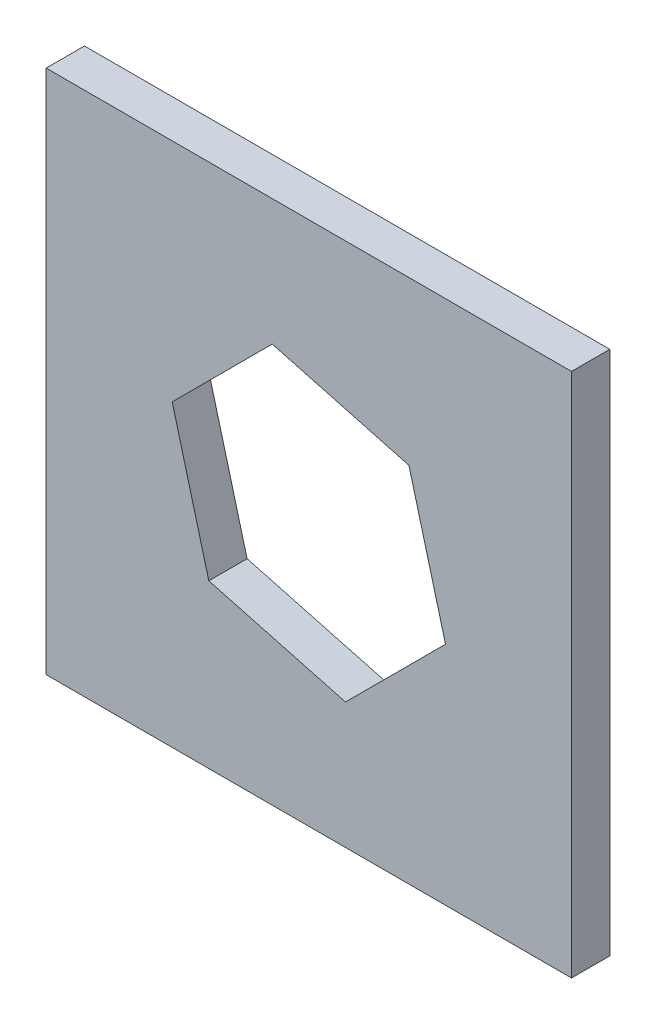
ISO-10303-21;
HEADER;
FILE_DESCRIPTION(('STEP AP214'),'2;1');
FILE_NAME('part.step','',(''),(''),'','','');
FILE_SCHEMA(('AUTOMOTIVE_DESIGN { 1 0 10303 214 1 1 1 1 }'));
ENDSEC;
DATA;
#1=APPLICATION_CONTEXT('core data for automotive mechanical design processes');
#2=APPLICATION_PROTOCOL_DEFINITION('international standard','automotive_design',2000,#1);
#3=PRODUCT_CONTEXT('',#1,'mechanical');
#4=PRODUCT('Part','Part','',(#3));
#5=PRODUCT_RELATED_PRODUCT_CATEGORY('part','',(#4));
#6=PRODUCT_DEFINITION_FORMATION('','',#4);
#7=PRODUCT_DEFINITION_CONTEXT('part definition',#1,'design');
#8=PRODUCT_DEFINITION('design','',#6,#7);
#9=PRODUCT_DEFINITION_SHAPE('','',#8);
#10=(LENGTH_UNIT() NAMED_UNIT(*) SI_UNIT(.MILLI.,.METRE.));
#11=(NAMED_UNIT(*) PLANE_ANGLE_UNIT() SI_UNIT($,.RADIAN.));
#12=(NAMED_UNIT(*) SI_UNIT($,.STERADIAN.) SOLID_ANGLE_UNIT());
#13=UNCERTAINTY_MEASURE_WITH_UNIT(LENGTH_MEASURE(1.E-05),#10,'distance_accuracy_value','');
#14=(GEOMETRIC_REPRESENTATION_CONTEXT(3) GLOBAL_UNCERTAINTY_ASSIGNED_CONTEXT((#13)) GLOBAL_UNIT_ASSIGNED_CONTEXT((#10,
#11,#12)) REPRESENTATION_CONTEXT('',''));
#15=CARTESIAN_POINT('',(0.,0.,0.));
#16=DIRECTION('',(0.,0.,1.));
#17=DIRECTION('',(1.,0.,0.));
#18=AXIS2_PLACEMENT_3D('',#15,#16,#17);
#19=CARTESIAN_POINT('',(0.,0.,2.5));
#20=DIRECTION('',(0.,0.,1.));
#21=DIRECTION('',(1.,0.,0.));
#22=AXIS2_PLACEMENT_3D('',#19,#20,#21);
#23=PLANE('',#22);
#24=DIRECTION('',(0.,-1.,0.));
#25=VECTOR('',#24,1.);
#26=CARTESIAN_POINT('',(-17.15,-17.15,2.5));
#27=LINE('',#26,#25);
#28=CARTESIAN_POINT('',(-17.15,17.15,2.5));
#29=VERTEX_POINT('',#28);
#30=CARTESIAN_POINT('',(-17.15,-17.15,2.5));
#31=VERTEX_POINT('',#30);
#32=EDGE_CURVE('E163',#29,#31,#27,.T.);
#33=ORIENTED_EDGE('',*,*,#32,.T.);
#34=DIRECTION('',(1.,0.,0.));
#35=VECTOR('',#34,1.);
#36=CARTESIAN_POINT('',(17.15,-17.15,2.5));
#37=LINE('',#36,#35);
#38=CARTESIAN_POINT('',(17.15,-17.15,2.5));
#39=VERTEX_POINT('',#38);
#40=EDGE_CURVE('E166',#31,#39,#37,.T.);
#41=ORIENTED_EDGE('',*,*,#40,.T.);
#42=DIRECTION('',(0.,1.,0.));
#43=VECTOR('',#42,1.);
#44=CARTESIAN_POINT('',(17.15,-17.15,2.5));
#45=LINE('',#44,#43);
#46=CARTESIAN_POINT('',(17.15,17.15,2.5));
#47=VERTEX_POINT('',#46);
#48=EDGE_CURVE('E169',#39,#47,#45,.T.);
#49=ORIENTED_EDGE('',*,*,#48,.T.);
#50=DIRECTION('',(-1.,0.,0.));
#51=VECTOR('',#50,1.);
#52=CARTESIAN_POINT('',(17.15,17.15,2.5));
#53=LINE('',#52,#51);
#54=EDGE_CURVE('E171',#47,#29,#53,.T.);
#55=ORIENTED_EDGE('',*,*,#54,.T.);
#56=EDGE_LOOP('',(#33,#41,#49,#55));
#57=FACE_BOUND('',#56,.T.);
#58=DIRECTION('',(-0.965925826289068,0.258819045102521,0.));
#59=VECTOR('',#58,1.);
#60=CARTESIAN_POINT('',(6.53197264742181,6.5319726474218,2.5));
#61=LINE('',#60,#59);
#62=CARTESIAN_POINT('',(6.53197264742181,6.5319726474218,2.5));
#63=VERTEX_POINT('',#62);
#64=CARTESIAN_POINT('',(-2.39086792578148,8.92284057320328,2.5));
#65=VERTEX_POINT('',#64);
#66=EDGE_CURVE('E120',#63,#65,#61,.T.);
#67=ORIENTED_EDGE('',*,*,#66,.F.);
#68=DIRECTION('',(-0.258819045102521,0.965925826289068,0.));
#69=VECTOR('',#68,1.);
#70=CARTESIAN_POINT('',(8.92284057320328,-2.39086792578148,2.5));
#71=LINE('',#70,#69);
#72=CARTESIAN_POINT('',(8.92284057320328,-2.39086792578148,2.5));
#73=VERTEX_POINT('',#72);
#74=EDGE_CURVE('E112',#73,#63,#71,.T.);
#75=ORIENTED_EDGE('',*,*,#74,.F.);
#76=DIRECTION('',(0.707106781186547,0.707106781186548,0.));
#77=VECTOR('',#76,1.);
#78=CARTESIAN_POINT('',(2.39086792578148,-8.92284057320329,2.5));
#79=LINE('',#78,#77);
#80=CARTESIAN_POINT('',(2.39086792578148,-8.92284057320329,2.5));
#81=VERTEX_POINT('',#80);
#82=EDGE_CURVE('E141',#81,#73,#79,.T.);
#83=ORIENTED_EDGE('',*,*,#82,.F.);
#84=DIRECTION('',(0.965925826289068,-0.258819045102521,0.));
#85=VECTOR('',#84,1.);
#86=CARTESIAN_POINT('',(-6.53197264742181,-6.53197264742181,2.5));
#87=LINE('',#86,#85);
#88=CARTESIAN_POINT('',(-6.53197264742181,-6.53197264742181,2.5));
#89=VERTEX_POINT('',#88);
#90=EDGE_CURVE('E139',#89,#81,#87,.T.);
#91=ORIENTED_EDGE('',*,*,#90,.F.);
#92=DIRECTION('',(0.258819045102521,-0.965925826289068,0.));
#93=VECTOR('',#92,1.);
#94=CARTESIAN_POINT('',(-8.92284057320329,2.39086792578147,2.5));
#95=LINE('',#94,#93);
#96=CARTESIAN_POINT('',(-8.92284057320329,2.39086792578147,2.5));
#97=VERTEX_POINT('',#96);
#98=EDGE_CURVE('E135',#97,#89,#95,.T.);
#99=ORIENTED_EDGE('',*,*,#98,.F.);
#100=DIRECTION('',(-0.707106781186547,-0.707106781186547,0.));
#101=VECTOR('',#100,1.);
#102=CARTESIAN_POINT('',(-2.39086792578148,8.92284057320328,2.5));
#103=LINE('',#102,#101);
#104=EDGE_CURVE('E133',#65,#97,#103,.T.);
#105=ORIENTED_EDGE('',*,*,#104,.F.);
#106=EDGE_LOOP('',(#67,#75,#83,#91,#99,#105));
#107=FACE_BOUND('',#106,.T.);
#108=ADVANCED_FACE('F35',(#57,#107),#23,.T.);
#109=CARTESIAN_POINT('',(0.,0.,0.));
#110=DIRECTION('',(0.,0.,1.));
#111=DIRECTION('',(1.,0.,0.));
#112=AXIS2_PLACEMENT_3D('',#109,#110,#111);
#113=PLANE('',#112);
#114=DIRECTION('',(0.,-1.,0.));
#115=VECTOR('',#114,1.);
#116=CARTESIAN_POINT('',(-17.15,-17.15,0.));
#117=LINE('',#116,#115);
#118=CARTESIAN_POINT('',(-17.15,17.15,0.));
#119=VERTEX_POINT('',#118);
#120=CARTESIAN_POINT('',(-17.15,-17.15,0.));
#121=VERTEX_POINT('',#120);
#122=EDGE_CURVE('E128',#119,#121,#117,.T.);
#123=ORIENTED_EDGE('',*,*,#122,.F.);
#124=DIRECTION('',(-1.,0.,0.));
#125=VECTOR('',#124,1.);
#126=CARTESIAN_POINT('',(17.15,17.15,0.));
#127=LINE('',#126,#125);
#128=CARTESIAN_POINT('',(17.15,17.15,0.));
#129=VERTEX_POINT('',#128);
#130=EDGE_CURVE('E167',#129,#119,#127,.T.);
#131=ORIENTED_EDGE('',*,*,#130,.F.);
#132=DIRECTION('',(0.,1.,0.));
#133=VECTOR('',#132,1.);
#134=CARTESIAN_POINT('',(17.15,-17.15,0.));
#135=LINE('',#134,#133);
#136=CARTESIAN_POINT('',(17.15,-17.15,0.));
#137=VERTEX_POINT('',#136);
#138=EDGE_CURVE('E178',#137,#129,#135,.T.);
#139=ORIENTED_EDGE('',*,*,#138,.F.);
#140=DIRECTION('',(1.,0.,0.));
#141=VECTOR('',#140,1.);
#142=CARTESIAN_POINT('',(17.15,-17.15,0.));
#143=LINE('',#142,#141);
#144=EDGE_CURVE('E176',#121,#137,#143,.T.);
#145=ORIENTED_EDGE('',*,*,#144,.F.);
#146=EDGE_LOOP('',(#123,#131,#139,#145));
#147=FACE_BOUND('',#146,.T.);
#148=DIRECTION('',(-0.258819045102521,0.965925826289068,0.));
#149=VECTOR('',#148,1.);
#150=CARTESIAN_POINT('',(8.92284057320328,-2.39086792578148,0.));
#151=LINE('',#150,#149);
#152=CARTESIAN_POINT('',(8.92284057320328,-2.39086792578148,0.));
#153=VERTEX_POINT('',#152);
#154=CARTESIAN_POINT('',(6.53197264742181,6.5319726474218,0.));
#155=VERTEX_POINT('',#154);
#156=EDGE_CURVE('E58',#153,#155,#151,.T.);
#157=ORIENTED_EDGE('',*,*,#156,.T.);
#158=DIRECTION('',(-0.965925826289068,0.258819045102521,0.));
#159=VECTOR('',#158,1.);
#160=CARTESIAN_POINT('',(6.53197264742181,6.5319726474218,0.));
#161=LINE('',#160,#159);
#162=CARTESIAN_POINT('',(-2.39086792578148,8.92284057320328,0.));
#163=VERTEX_POINT('',#162);
#164=EDGE_CURVE('E127',#155,#163,#161,.T.);
#165=ORIENTED_EDGE('',*,*,#164,.T.);
#166=DIRECTION('',(-0.707106781186547,-0.707106781186547,0.));
#167=VECTOR('',#166,1.);
#168=CARTESIAN_POINT('',(-2.39086792578148,8.92284057320328,0.));
#169=LINE('',#168,#167);
#170=CARTESIAN_POINT('',(-8.92284057320329,2.39086792578147,0.));
#171=VERTEX_POINT('',#170);
#172=EDGE_CURVE('E145',#163,#171,#169,.T.);
#173=ORIENTED_EDGE('',*,*,#172,.T.);
#174=DIRECTION('',(0.258819045102521,-0.965925826289068,0.));
#175=VECTOR('',#174,1.);
#176=CARTESIAN_POINT('',(-8.92284057320329,2.39086792578147,0.));
#177=LINE('',#176,#175);
#178=CARTESIAN_POINT('',(-6.53197264742181,-6.53197264742181,0.));
#179=VERTEX_POINT('',#178);
#180=EDGE_CURVE('E148',#171,#179,#177,.T.);
#181=ORIENTED_EDGE('',*,*,#180,.T.);
#182=DIRECTION('',(0.965925826289068,-0.258819045102521,0.));
#183=VECTOR('',#182,1.);
#184=CARTESIAN_POINT('',(-6.53197264742181,-6.53197264742181,0.));
#185=LINE('',#184,#183);
#186=CARTESIAN_POINT('',(2.39086792578148,-8.92284057320329,0.));
#187=VERTEX_POINT('',#186);
#188=EDGE_CURVE('E151',#179,#187,#185,.T.);
#189=ORIENTED_EDGE('',*,*,#188,.T.);
#190=DIRECTION('',(0.707106781186547,0.707106781186548,0.));
#191=VECTOR('',#190,1.);
#192=CARTESIAN_POINT('',(2.39086792578148,-8.92284057320329,0.));
#193=LINE('',#192,#191);
#194=EDGE_CURVE('E121',#187,#153,#193,.T.);
#195=ORIENTED_EDGE('',*,*,#194,.T.);
#196=EDGE_LOOP('',(#157,#165,#173,#181,#189,#195));
#197=FACE_BOUND('',#196,.T.);
#198=ADVANCED_FACE('F196',(#147,#197),#113,.F.);
#199=CARTESIAN_POINT('',(-17.15,-17.15,2.5));
#200=DIRECTION('',(1.,0.,0.));
#201=DIRECTION('',(0.,0.,-1.));
#202=AXIS2_PLACEMENT_3D('',#199,#200,#201);
#203=PLANE('',#202);
#204=ORIENTED_EDGE('',*,*,#122,.T.);
#205=DIRECTION('',(0.,0.,-1.));
#206=VECTOR('',#205,1.);
#207=CARTESIAN_POINT('',(-17.15,-17.15,2.5));
#208=LINE('',#207,#206);
#209=EDGE_CURVE('E11',#31,#121,#208,.T.);
#210=ORIENTED_EDGE('',*,*,#209,.F.);
#211=ORIENTED_EDGE('',*,*,#32,.F.);
#212=DIRECTION('',(0.,0.,-1.));
#213=VECTOR('',#212,1.);
#214=CARTESIAN_POINT('',(-17.15,17.15,2.5));
#215=LINE('',#214,#213);
#216=EDGE_CURVE('E173',#29,#119,#215,.T.);
#217=ORIENTED_EDGE('',*,*,#216,.T.);
#218=EDGE_LOOP('',(#204,#210,#211,#217));
#219=FACE_BOUND('',#218,.T.);
#220=ADVANCED_FACE('F37',(#219),#203,.F.);
#221=CARTESIAN_POINT('',(17.15,-17.15,2.5));
#222=DIRECTION('',(0.,1.,0.));
#223=DIRECTION('',(-1.,0.,0.));
#224=AXIS2_PLACEMENT_3D('',#221,#222,#223);
#225=PLANE('',#224);
#226=ORIENTED_EDGE('',*,*,#144,.T.);
#227=DIRECTION('',(0.,0.,-1.));
#228=VECTOR('',#227,1.);
#229=CARTESIAN_POINT('',(17.15,-17.15,2.5));
#230=LINE('',#229,#228);
#231=EDGE_CURVE('E43',#39,#137,#230,.T.);
#232=ORIENTED_EDGE('',*,*,#231,.F.);
#233=ORIENTED_EDGE('',*,*,#40,.F.);
#234=ORIENTED_EDGE('',*,*,#209,.T.);
#235=EDGE_LOOP('',(#226,#232,#233,#234));
#236=FACE_BOUND('',#235,.T.);
#237=ADVANCED_FACE('F206',(#236),#225,.F.);
#238=CARTESIAN_POINT('',(17.15,-17.15,2.5));
#239=DIRECTION('',(-1.,0.,0.));
#240=DIRECTION('',(0.,0.,1.));
#241=AXIS2_PLACEMENT_3D('',#238,#239,#240);
#242=PLANE('',#241);
#243=ORIENTED_EDGE('',*,*,#138,.T.);
#244=DIRECTION('',(0.,0.,-1.));
#245=VECTOR('',#244,1.);
#246=CARTESIAN_POINT('',(17.15,17.15,2.5));
#247=LINE('',#246,#245);
#248=EDGE_CURVE('E183',#47,#129,#247,.T.);
#249=ORIENTED_EDGE('',*,*,#248,.F.);
#250=ORIENTED_EDGE('',*,*,#48,.F.);
#251=ORIENTED_EDGE('',*,*,#231,.T.);
#252=EDGE_LOOP('',(#243,#249,#250,#251));
#253=FACE_BOUND('',#252,.T.);
#254=ADVANCED_FACE('F190',(#253),#242,.F.);
#255=CARTESIAN_POINT('',(17.15,17.15,2.5));
#256=DIRECTION('',(0.,-1.,0.));
#257=DIRECTION('',(1.,0.,0.));
#258=AXIS2_PLACEMENT_3D('',#255,#256,#257);
#259=PLANE('',#258);
#260=ORIENTED_EDGE('',*,*,#130,.T.);
#261=ORIENTED_EDGE('',*,*,#216,.F.);
#262=ORIENTED_EDGE('',*,*,#54,.F.);
#263=ORIENTED_EDGE('',*,*,#248,.T.);
#264=EDGE_LOOP('',(#260,#261,#262,#263));
#265=FACE_BOUND('',#264,.T.);
#266=ADVANCED_FACE('F200',(#265),#259,.F.);
#267=CARTESIAN_POINT('',(8.92284057320328,-2.39086792578148,2.5));
#268=DIRECTION('',(-0.965925826289068,-0.258819045102521,0.));
#269=DIRECTION('',(0.258819045102521,-0.965925826289068,0.));
#270=AXIS2_PLACEMENT_3D('',#267,#268,#269);
#271=PLANE('',#270);
#272=ORIENTED_EDGE('',*,*,#156,.F.);
#273=DIRECTION('',(0.,0.,-1.));
#274=VECTOR('',#273,1.);
#275=CARTESIAN_POINT('',(8.92284057320328,-2.39086792578148,2.5));
#276=LINE('',#275,#274);
#277=EDGE_CURVE('E116',#73,#153,#276,.T.);
#278=ORIENTED_EDGE('',*,*,#277,.F.);
#279=ORIENTED_EDGE('',*,*,#74,.T.);
#280=DIRECTION('',(0.,0.,-1.));
#281=VECTOR('',#280,1.);
#282=CARTESIAN_POINT('',(6.53197264742181,6.5319726474218,2.5));
#283=LINE('',#282,#281);
#284=EDGE_CURVE('E115',#63,#155,#283,.T.);
#285=ORIENTED_EDGE('',*,*,#284,.T.);
#286=EDGE_LOOP('',(#272,#278,#279,#285));
#287=FACE_BOUND('',#286,.T.);
#288=ADVANCED_FACE('F114',(#287),#271,.T.);
#289=CARTESIAN_POINT('',(6.53197264742181,6.5319726474218,2.5));
#290=DIRECTION('',(-0.258819045102521,-0.965925826289068,0.));
#291=DIRECTION('',(0.965925826289068,-0.258819045102521,0.));
#292=AXIS2_PLACEMENT_3D('',#289,#290,#291);
#293=PLANE('',#292);
#294=ORIENTED_EDGE('',*,*,#164,.F.);
#295=ORIENTED_EDGE('',*,*,#284,.F.);
#296=ORIENTED_EDGE('',*,*,#66,.T.);
#297=DIRECTION('',(0.,0.,-1.));
#298=VECTOR('',#297,1.);
#299=CARTESIAN_POINT('',(-2.39086792578148,8.92284057320328,2.5));
#300=LINE('',#299,#298);
#301=EDGE_CURVE('E129',#65,#163,#300,.T.);
#302=ORIENTED_EDGE('',*,*,#301,.T.);
#303=EDGE_LOOP('',(#294,#295,#296,#302));
#304=FACE_BOUND('',#303,.T.);
#305=ADVANCED_FACE('F124',(#304),#293,.T.);
#306=CARTESIAN_POINT('',(-2.39086792578148,8.92284057320328,2.5));
#307=DIRECTION('',(0.707106781186548,-0.707106781186547,0.));
#308=DIRECTION('',(0.707106781186547,0.707106781186548,0.));
#309=AXIS2_PLACEMENT_3D('',#306,#307,#308);
#310=PLANE('',#309);
#311=ORIENTED_EDGE('',*,*,#172,.F.);
#312=ORIENTED_EDGE('',*,*,#301,.F.);
#313=ORIENTED_EDGE('',*,*,#104,.T.);
#314=DIRECTION('',(0.,0.,-1.));
#315=VECTOR('',#314,1.);
#316=CARTESIAN_POINT('',(-8.92284057320329,2.39086792578147,2.5));
#317=LINE('',#316,#315);
#318=EDGE_CURVE('E160',#97,#171,#317,.T.);
#319=ORIENTED_EDGE('',*,*,#318,.T.);
#320=EDGE_LOOP('',(#311,#312,#313,#319));
#321=FACE_BOUND('',#320,.T.);
#322=ADVANCED_FACE('F229',(#321),#310,.T.);
#323=CARTESIAN_POINT('',(-8.92284057320329,2.39086792578147,2.5));
#324=DIRECTION('',(0.965925826289068,0.258819045102521,0.));
#325=DIRECTION('',(-0.258819045102521,0.965925826289068,0.));
#326=AXIS2_PLACEMENT_3D('',#323,#324,#325);
#327=PLANE('',#326);
#328=ORIENTED_EDGE('',*,*,#180,.F.);
#329=ORIENTED_EDGE('',*,*,#318,.F.);
#330=ORIENTED_EDGE('',*,*,#98,.T.);
#331=DIRECTION('',(0.,0.,-1.));
#332=VECTOR('',#331,1.);
#333=CARTESIAN_POINT('',(-6.53197264742181,-6.53197264742181,2.5));
#334=LINE('',#333,#332);
#335=EDGE_CURVE('E158',#89,#179,#334,.T.);
#336=ORIENTED_EDGE('',*,*,#335,.T.);
#337=EDGE_LOOP('',(#328,#329,#330,#336));
#338=FACE_BOUND('',#337,.T.);
#339=ADVANCED_FACE('F233',(#338),#327,.T.);
#340=CARTESIAN_POINT('',(-6.53197264742181,-6.53197264742181,2.5));
#341=DIRECTION('',(0.258819045102521,0.965925826289068,0.));
#342=DIRECTION('',(-0.965925826289068,0.258819045102521,0.));
#343=AXIS2_PLACEMENT_3D('',#340,#341,#342);
#344=PLANE('',#343);
#345=ORIENTED_EDGE('',*,*,#188,.F.);
#346=ORIENTED_EDGE('',*,*,#335,.F.);
#347=ORIENTED_EDGE('',*,*,#90,.T.);
#348=DIRECTION('',(0.,0.,-1.));
#349=VECTOR('',#348,1.);
#350=CARTESIAN_POINT('',(2.39086792578148,-8.92284057320329,2.5));
#351=LINE('',#350,#349);
#352=EDGE_CURVE('E50',#81,#187,#351,.T.);
#353=ORIENTED_EDGE('',*,*,#352,.T.);
#354=EDGE_LOOP('',(#345,#346,#347,#353));
#355=FACE_BOUND('',#354,.T.);
#356=ADVANCED_FACE('F239',(#355),#344,.T.);
#357=CARTESIAN_POINT('',(2.39086792578148,-8.92284057320329,2.5));
#358=DIRECTION('',(-0.707106781186548,0.707106781186547,0.));
#359=DIRECTION('',(-0.707106781186547,-0.707106781186548,0.));
#360=AXIS2_PLACEMENT_3D('',#357,#358,#359);
#361=PLANE('',#360);
#362=ORIENTED_EDGE('',*,*,#194,.F.);
#363=ORIENTED_EDGE('',*,*,#352,.F.);
#364=ORIENTED_EDGE('',*,*,#82,.T.);
#365=ORIENTED_EDGE('',*,*,#277,.T.);
#366=EDGE_LOOP('',(#362,#363,#364,#365));
#367=FACE_BOUND('',#366,.T.);
#368=ADVANCED_FACE('F243',(#367),#361,.T.);
#369=CLOSED_SHELL('',(#108,#198,#220,#237,#254,#266,#288,#305,#322,#339,#356,#368));
#370=MANIFOLD_SOLID_BREP('B2',#369);
#371=ADVANCED_BREP_SHAPE_REPRESENTATION('',(#18,#370),#14);
#372=SHAPE_DEFINITION_REPRESENTATION(#9,#371);
ENDSEC;
END-ISO-10303-21;
